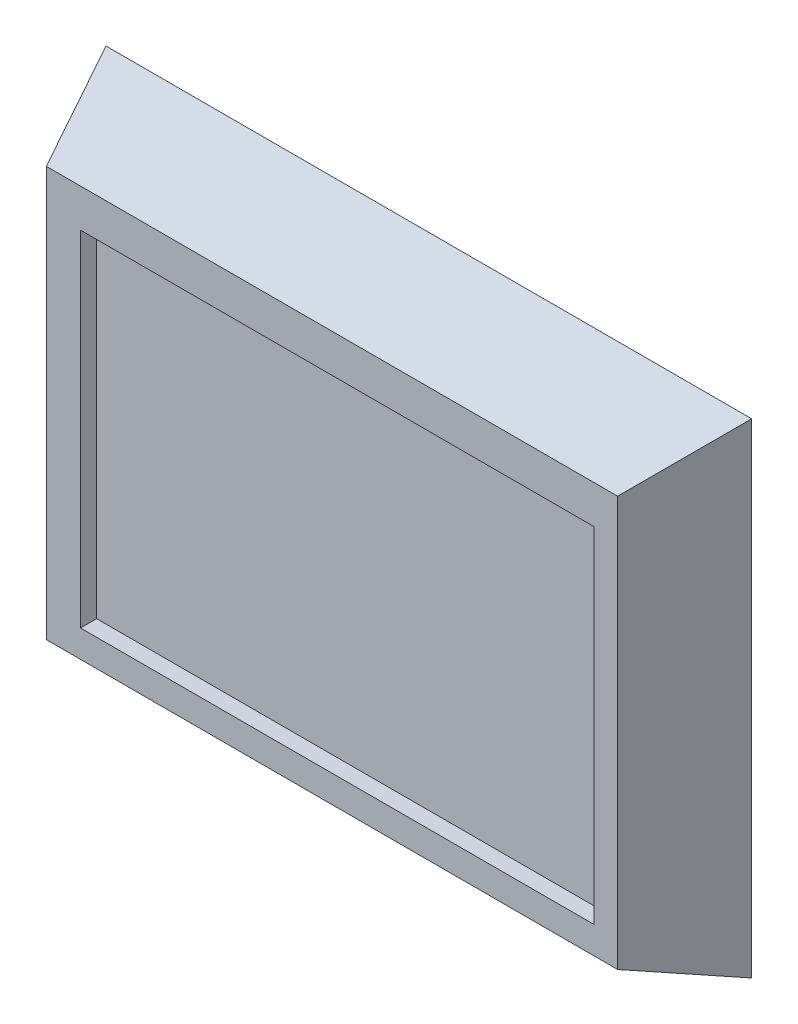
ISO-10303-21;
HEADER;
FILE_DESCRIPTION(('STEP AP214'),'2;1');
FILE_NAME('part.step','',(''),(''),'','','');
FILE_SCHEMA(('AUTOMOTIVE_DESIGN { 1 0 10303 214 1 1 1 1 }'));
ENDSEC;
DATA;
#1=APPLICATION_CONTEXT('core data for automotive mechanical design processes');
#2=APPLICATION_PROTOCOL_DEFINITION('international standard','automotive_design',2000,#1);
#3=PRODUCT_CONTEXT('',#1,'mechanical');
#4=PRODUCT('Part','Part','',(#3));
#5=PRODUCT_RELATED_PRODUCT_CATEGORY('part','',(#4));
#6=PRODUCT_DEFINITION_FORMATION('','',#4);
#7=PRODUCT_DEFINITION_CONTEXT('part definition',#1,'design');
#8=PRODUCT_DEFINITION('design','',#6,#7);
#9=PRODUCT_DEFINITION_SHAPE('','',#8);
#10=(LENGTH_UNIT() NAMED_UNIT(*) SI_UNIT(.MILLI.,.METRE.));
#11=(NAMED_UNIT(*) PLANE_ANGLE_UNIT() SI_UNIT($,.RADIAN.));
#12=(NAMED_UNIT(*) SI_UNIT($,.STERADIAN.) SOLID_ANGLE_UNIT());
#13=UNCERTAINTY_MEASURE_WITH_UNIT(LENGTH_MEASURE(1.E-05),#10,'distance_accuracy_value','');
#14=(GEOMETRIC_REPRESENTATION_CONTEXT(3) GLOBAL_UNCERTAINTY_ASSIGNED_CONTEXT((#13)) GLOBAL_UNIT_ASSIGNED_CONTEXT((#10,
#11,#12)) REPRESENTATION_CONTEXT('',''));
#15=CARTESIAN_POINT('',(0.,0.,0.));
#16=DIRECTION('',(0.,0.,1.));
#17=DIRECTION('',(1.,0.,0.));
#18=AXIS2_PLACEMENT_3D('',#15,#16,#17);
#19=CARTESIAN_POINT('',(0.,0.,0.));
#20=DIRECTION('',(-0.933580426497202,0.,0.3583679495453));
#21=DIRECTION('',(0.3583679495453,0.,0.933580426497202));
#22=AXIS2_PLACEMENT_3D('',#19,#20,#21);
#23=PLANE('',#22);
#24=DIRECTION('',(0.,-1.,0.));
#25=VECTOR('',#24,1.);
#26=CARTESIAN_POINT('',(0.,0.,0.));
#27=LINE('',#26,#25);
#28=CARTESIAN_POINT('',(0.,150.,0.));
#29=VERTEX_POINT('',#28);
#30=CARTESIAN_POINT('',(0.,0.,0.));
#31=VERTEX_POINT('',#30);
#32=EDGE_CURVE('E134',#29,#31,#27,.T.);
#33=ORIENTED_EDGE('',*,*,#32,.T.);
#34=DIRECTION('',(-0.33735901058771,-0.33735901058771,-0.878850269357962));
#35=VECTOR('',#34,1.);
#36=CARTESIAN_POINT('',(0.,0.,0.));
#37=LINE('',#36,#35);
#38=CARTESIAN_POINT('',(11.5159210510625,11.5159210510625,30.));
#39=VERTEX_POINT('',#38);
#40=EDGE_CURVE('E11',#39,#31,#37,.T.);
#41=ORIENTED_EDGE('',*,*,#40,.F.);
#42=DIRECTION('',(0.,1.,0.));
#43=VECTOR('',#42,1.);
#44=CARTESIAN_POINT('',(11.5159210510625,0.,30.));
#45=LINE('',#44,#43);
#46=CARTESIAN_POINT('',(11.5159210510625,138.484078948938,30.));
#47=VERTEX_POINT('',#46);
#48=EDGE_CURVE('E145',#47,#39,#45,.F.);
#49=ORIENTED_EDGE('',*,*,#48,.F.);
#50=DIRECTION('',(-0.33735901058771,0.33735901058771,-0.878850269357962));
#51=VECTOR('',#50,1.);
#52=CARTESIAN_POINT('',(17.0716653037078,132.928334696292,44.4732085988017));
#53=LINE('',#52,#51);
#54=EDGE_CURVE('E147',#47,#29,#53,.T.);
#55=ORIENTED_EDGE('',*,*,#54,.T.);
#56=EDGE_LOOP('',(#33,#41,#49,#55));
#57=FACE_BOUND('',#56,.T.);
#58=ADVANCED_FACE('F32',(#57),#23,.T.);
#59=CARTESIAN_POINT('',(0.,0.,0.));
#60=DIRECTION('',(0.,-0.933580426497202,0.3583679495453));
#61=DIRECTION('',(0.,-0.3583679495453,-0.933580426497202));
#62=AXIS2_PLACEMENT_3D('',#59,#60,#61);
#63=PLANE('',#62);
#64=DIRECTION('',(1.,0.,0.));
#65=VECTOR('',#64,1.);
#66=CARTESIAN_POINT('',(0.,0.,0.));
#67=LINE('',#66,#65);
#68=CARTESIAN_POINT('',(200.,0.,0.));
#69=VERTEX_POINT('',#68);
#70=EDGE_CURVE('E140',#31,#69,#67,.T.);
#71=ORIENTED_EDGE('',*,*,#70,.T.);
#72=DIRECTION('',(0.33735901058771,-0.33735901058771,-0.878850269357962));
#73=VECTOR('',#72,1.);
#74=CARTESIAN_POINT('',(200.,0.,0.));
#75=LINE('',#74,#73);
#76=CARTESIAN_POINT('',(188.484078948938,11.5159210510625,30.));
#77=VERTEX_POINT('',#76);
#78=EDGE_CURVE('E41',#77,#69,#75,.T.);
#79=ORIENTED_EDGE('',*,*,#78,.F.);
#80=DIRECTION('',(-1.,0.,0.));
#81=VECTOR('',#80,1.);
#82=CARTESIAN_POINT('',(0.,11.5159210510625,30.));
#83=LINE('',#82,#81);
#84=EDGE_CURVE('E156',#39,#77,#83,.F.);
#85=ORIENTED_EDGE('',*,*,#84,.F.);
#86=ORIENTED_EDGE('',*,*,#40,.T.);
#87=EDGE_LOOP('',(#71,#79,#85,#86));
#88=FACE_BOUND('',#87,.T.);
#89=ADVANCED_FACE('F34',(#88),#63,.T.);
#90=CARTESIAN_POINT('',(200.,0.,0.));
#91=DIRECTION('',(0.933580426497202,0.,0.3583679495453));
#92=DIRECTION('',(0.3583679495453,0.,-0.933580426497202));
#93=AXIS2_PLACEMENT_3D('',#90,#91,#92);
#94=PLANE('',#93);
#95=DIRECTION('',(0.,1.,0.));
#96=VECTOR('',#95,1.);
#97=CARTESIAN_POINT('',(200.,0.,0.));
#98=LINE('',#97,#96);
#99=CARTESIAN_POINT('',(200.,150.,0.));
#100=VERTEX_POINT('',#99);
#101=EDGE_CURVE('E142',#69,#100,#98,.T.);
#102=ORIENTED_EDGE('',*,*,#101,.T.);
#103=DIRECTION('',(0.33735901058771,0.33735901058771,-0.878850269357962));
#104=VECTOR('',#103,1.);
#105=CARTESIAN_POINT('',(177.237779595056,127.237779595056,59.2976114650689));
#106=LINE('',#105,#104);
#107=CARTESIAN_POINT('',(188.484078948938,138.484078948938,30.));
#108=VERTEX_POINT('',#107);
#109=EDGE_CURVE('E150',#108,#100,#106,.T.);
#110=ORIENTED_EDGE('',*,*,#109,.F.);
#111=DIRECTION('',(0.,-1.,0.));
#112=VECTOR('',#111,1.);
#113=CARTESIAN_POINT('',(188.484078948938,0.,30.));
#114=LINE('',#113,#112);
#115=EDGE_CURVE('E157',#77,#108,#114,.F.);
#116=ORIENTED_EDGE('',*,*,#115,.F.);
#117=ORIENTED_EDGE('',*,*,#78,.T.);
#118=EDGE_LOOP('',(#102,#110,#116,#117));
#119=FACE_BOUND('',#118,.T.);
#120=ADVANCED_FACE('F163',(#119),#94,.T.);
#121=CARTESIAN_POINT('',(0.,150.,0.));
#122=DIRECTION('',(0.,0.933580426497202,0.3583679495453));
#123=DIRECTION('',(0.,-0.3583679495453,0.933580426497202));
#124=AXIS2_PLACEMENT_3D('',#121,#122,#123);
#125=PLANE('',#124);
#126=DIRECTION('',(-1.,0.,0.));
#127=VECTOR('',#126,1.);
#128=CARTESIAN_POINT('',(0.,150.,0.));
#129=LINE('',#128,#127);
#130=EDGE_CURVE('E144',#100,#29,#129,.T.);
#131=ORIENTED_EDGE('',*,*,#130,.T.);
#132=ORIENTED_EDGE('',*,*,#54,.F.);
#133=DIRECTION('',(1.,0.,0.));
#134=VECTOR('',#133,1.);
#135=CARTESIAN_POINT('',(0.,138.484078948938,30.));
#136=LINE('',#135,#134);
#137=EDGE_CURVE('E36',#108,#47,#136,.F.);
#138=ORIENTED_EDGE('',*,*,#137,.F.);
#139=ORIENTED_EDGE('',*,*,#109,.T.);
#140=EDGE_LOOP('',(#131,#132,#138,#139));
#141=FACE_BOUND('',#140,.T.);
#142=ADVANCED_FACE('F167',(#141),#125,.T.);
#143=CARTESIAN_POINT('',(0.,0.,30.));
#144=DIRECTION('',(0.,0.,-1.));
#145=DIRECTION('',(-1.,0.,0.));
#146=AXIS2_PLACEMENT_3D('',#143,#144,#145);
#147=PLANE('',#146);
#148=DIRECTION('',(1.,0.,0.));
#149=VECTOR('',#148,1.);
#150=CARTESIAN_POINT('',(22.1027346554123,19.9400765254154,30.));
#151=LINE('',#150,#149);
#152=CARTESIAN_POINT('',(22.1027346554123,19.9400765254154,30.));
#153=VERTEX_POINT('',#152);
#154=CARTESIAN_POINT('',(181.205161768396,19.9400765254154,30.));
#155=VERTEX_POINT('',#154);
#156=EDGE_CURVE('E128',#153,#155,#151,.T.);
#157=ORIENTED_EDGE('',*,*,#156,.F.);
#158=DIRECTION('',(0.,-1.,0.));
#159=VECTOR('',#158,1.);
#160=CARTESIAN_POINT('',(22.1027346554123,126.662909298659,30.));
#161=LINE('',#160,#159);
#162=CARTESIAN_POINT('',(22.1027346554123,126.662909298659,30.));
#163=VERTEX_POINT('',#162);
#164=EDGE_CURVE('E49',#163,#153,#161,.T.);
#165=ORIENTED_EDGE('',*,*,#164,.F.);
#166=DIRECTION('',(-1.,0.,0.));
#167=VECTOR('',#166,1.);
#168=CARTESIAN_POINT('',(22.1027346554123,126.662909298659,30.));
#169=LINE('',#168,#167);
#170=CARTESIAN_POINT('',(181.205161768396,126.662909298659,30.));
#171=VERTEX_POINT('',#170);
#172=EDGE_CURVE('E119',#171,#163,#169,.T.);
#173=ORIENTED_EDGE('',*,*,#172,.F.);
#174=DIRECTION('',(0.,1.,0.));
#175=VECTOR('',#174,1.);
#176=CARTESIAN_POINT('',(181.205161768396,126.662909298659,30.));
#177=LINE('',#176,#175);
#178=EDGE_CURVE('E122',#155,#171,#177,.T.);
#179=ORIENTED_EDGE('',*,*,#178,.F.);
#180=EDGE_LOOP('',(#157,#165,#173,#179));
#181=FACE_BOUND('',#180,.T.);
#182=ORIENTED_EDGE('',*,*,#48,.T.);
#183=ORIENTED_EDGE('',*,*,#84,.T.);
#184=ORIENTED_EDGE('',*,*,#115,.T.);
#185=ORIENTED_EDGE('',*,*,#137,.T.);
#186=EDGE_LOOP('',(#182,#183,#184,#185));
#187=FACE_BOUND('',#186,.T.);
#188=ADVANCED_FACE('F160',(#181,#187),#147,.F.);
#189=CARTESIAN_POINT('',(0.,0.,0.));
#190=DIRECTION('',(0.,0.,-1.));
#191=DIRECTION('',(-1.,0.,0.));
#192=AXIS2_PLACEMENT_3D('',#189,#190,#191);
#193=PLANE('',#192);
#194=ORIENTED_EDGE('',*,*,#32,.F.);
#195=ORIENTED_EDGE('',*,*,#130,.F.);
#196=ORIENTED_EDGE('',*,*,#101,.F.);
#197=ORIENTED_EDGE('',*,*,#70,.F.);
#198=EDGE_LOOP('',(#194,#195,#196,#197));
#199=FACE_BOUND('',#198,.T.);
#200=ADVANCED_FACE('F174',(#199),#193,.T.);
#201=CARTESIAN_POINT('',(22.1027346554123,126.662909298659,25.));
#202=DIRECTION('',(-1.,0.,0.));
#203=DIRECTION('',(0.,0.,1.));
#204=AXIS2_PLACEMENT_3D('',#201,#202,#203);
#205=PLANE('',#204);
#206=ORIENTED_EDGE('',*,*,#164,.T.);
#207=DIRECTION('',(0.,0.,1.));
#208=VECTOR('',#207,1.);
#209=CARTESIAN_POINT('',(22.1027346554123,19.9400765254154,25.));
#210=LINE('',#209,#208);
#211=CARTESIAN_POINT('',(22.1027346554123,19.9400765254154,25.));
#212=VERTEX_POINT('',#211);
#213=EDGE_CURVE('E97',#212,#153,#210,.T.);
#214=ORIENTED_EDGE('',*,*,#213,.F.);
#215=DIRECTION('',(0.,-1.,0.));
#216=VECTOR('',#215,1.);
#217=CARTESIAN_POINT('',(22.1027346554123,126.662909298659,25.));
#218=LINE('',#217,#216);
#219=CARTESIAN_POINT('',(22.1027346554123,126.662909298659,25.));
#220=VERTEX_POINT('',#219);
#221=EDGE_CURVE('E101',#220,#212,#218,.T.);
#222=ORIENTED_EDGE('',*,*,#221,.F.);
#223=DIRECTION('',(0.,0.,1.));
#224=VECTOR('',#223,1.);
#225=CARTESIAN_POINT('',(22.1027346554123,126.662909298659,25.));
#226=LINE('',#225,#224);
#227=EDGE_CURVE('E132',#220,#163,#226,.T.);
#228=ORIENTED_EDGE('',*,*,#227,.T.);
#229=EDGE_LOOP('',(#206,#214,#222,#228));
#230=FACE_BOUND('',#229,.T.);
#231=ADVANCED_FACE('F99',(#230),#205,.F.);
#232=CARTESIAN_POINT('',(22.1027346554123,126.662909298659,25.));
#233=DIRECTION('',(0.,1.,0.));
#234=DIRECTION('',(0.,0.,1.));
#235=AXIS2_PLACEMENT_3D('',#232,#233,#234);
#236=PLANE('',#235);
#237=ORIENTED_EDGE('',*,*,#172,.T.);
#238=ORIENTED_EDGE('',*,*,#227,.F.);
#239=DIRECTION('',(-1.,0.,0.));
#240=VECTOR('',#239,1.);
#241=CARTESIAN_POINT('',(22.1027346554123,126.662909298659,25.));
#242=LINE('',#241,#240);
#243=CARTESIAN_POINT('',(181.205161768396,126.662909298659,25.));
#244=VERTEX_POINT('',#243);
#245=EDGE_CURVE('E107',#244,#220,#242,.T.);
#246=ORIENTED_EDGE('',*,*,#245,.F.);
#247=DIRECTION('',(0.,0.,1.));
#248=VECTOR('',#247,1.);
#249=CARTESIAN_POINT('',(181.205161768396,126.662909298659,25.));
#250=LINE('',#249,#248);
#251=EDGE_CURVE('E135',#244,#171,#250,.T.);
#252=ORIENTED_EDGE('',*,*,#251,.T.);
#253=EDGE_LOOP('',(#237,#238,#246,#252));
#254=FACE_BOUND('',#253,.T.);
#255=ADVANCED_FACE('F181',(#254),#236,.F.);
#256=CARTESIAN_POINT('',(181.205161768396,126.662909298659,25.));
#257=DIRECTION('',(1.,0.,0.));
#258=DIRECTION('',(0.,0.,-1.));
#259=AXIS2_PLACEMENT_3D('',#256,#257,#258);
#260=PLANE('',#259);
#261=ORIENTED_EDGE('',*,*,#178,.T.);
#262=ORIENTED_EDGE('',*,*,#251,.F.);
#263=DIRECTION('',(0.,1.,0.));
#264=VECTOR('',#263,1.);
#265=CARTESIAN_POINT('',(181.205161768396,126.662909298659,25.));
#266=LINE('',#265,#264);
#267=CARTESIAN_POINT('',(181.205161768396,19.9400765254154,25.));
#268=VERTEX_POINT('',#267);
#269=EDGE_CURVE('E115',#268,#244,#266,.T.);
#270=ORIENTED_EDGE('',*,*,#269,.F.);
#271=DIRECTION('',(0.,0.,1.));
#272=VECTOR('',#271,1.);
#273=CARTESIAN_POINT('',(181.205161768396,19.9400765254154,25.));
#274=LINE('',#273,#272);
#275=EDGE_CURVE('E106',#268,#155,#274,.T.);
#276=ORIENTED_EDGE('',*,*,#275,.T.);
#277=EDGE_LOOP('',(#261,#262,#270,#276));
#278=FACE_BOUND('',#277,.T.);
#279=ADVANCED_FACE('F222',(#278),#260,.F.);
#280=CARTESIAN_POINT('',(22.1027346554123,19.9400765254154,25.));
#281=DIRECTION('',(0.,-1.,0.));
#282=DIRECTION('',(0.,0.,-1.));
#283=AXIS2_PLACEMENT_3D('',#280,#281,#282);
#284=PLANE('',#283);
#285=ORIENTED_EDGE('',*,*,#156,.T.);
#286=ORIENTED_EDGE('',*,*,#275,.F.);
#287=DIRECTION('',(1.,0.,0.));
#288=VECTOR('',#287,1.);
#289=CARTESIAN_POINT('',(22.1027346554123,19.9400765254154,25.));
#290=LINE('',#289,#288);
#291=EDGE_CURVE('E110',#212,#268,#290,.T.);
#292=ORIENTED_EDGE('',*,*,#291,.F.);
#293=ORIENTED_EDGE('',*,*,#213,.T.);
#294=EDGE_LOOP('',(#285,#286,#292,#293));
#295=FACE_BOUND('',#294,.T.);
#296=ADVANCED_FACE('F111',(#295),#284,.F.);
#297=CARTESIAN_POINT('',(0.,0.,25.));
#298=DIRECTION('',(0.,0.,1.));
#299=DIRECTION('',(1.,0.,0.));
#300=AXIS2_PLACEMENT_3D('',#297,#298,#299);
#301=PLANE('',#300);
#302=ORIENTED_EDGE('',*,*,#221,.T.);
#303=ORIENTED_EDGE('',*,*,#291,.T.);
#304=ORIENTED_EDGE('',*,*,#269,.T.);
#305=ORIENTED_EDGE('',*,*,#245,.T.);
#306=EDGE_LOOP('',(#302,#303,#304,#305));
#307=FACE_BOUND('',#306,.T.);
#308=ADVANCED_FACE('F117',(#307),#301,.T.);
#309=CLOSED_SHELL('',(#58,#89,#120,#142,#188,#200,#231,#255,#279,#296,#308));
#310=MANIFOLD_SOLID_BREP('B2',#309);
#311=ADVANCED_BREP_SHAPE_REPRESENTATION('',(#18,#310),#14);
#312=SHAPE_DEFINITION_REPRESENTATION(#9,#311);
ENDSEC;
END-ISO-10303-21;
